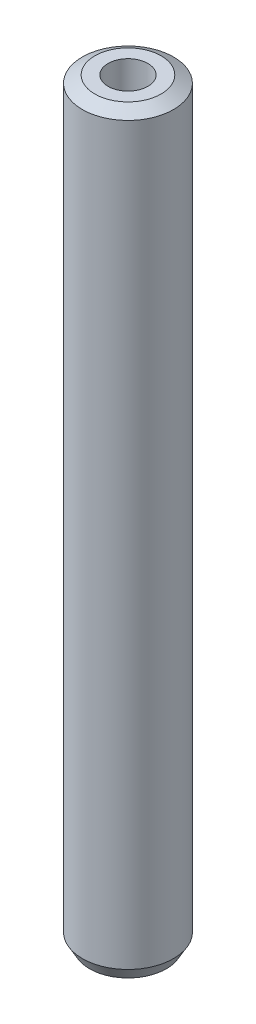
ISO-10303-21;
HEADER;
FILE_DESCRIPTION(('STEP AP214'),'2;1');
FILE_NAME('part.step','',(''),(''),'','','');
FILE_SCHEMA(('AUTOMOTIVE_DESIGN { 1 0 10303 214 1 1 1 1 }'));
ENDSEC;
DATA;
#1=APPLICATION_CONTEXT('core data for automotive mechanical design processes');
#2=APPLICATION_PROTOCOL_DEFINITION('international standard','automotive_design',2000,#1);
#3=PRODUCT_CONTEXT('',#1,'mechanical');
#4=PRODUCT('Part','Part','',(#3));
#5=PRODUCT_RELATED_PRODUCT_CATEGORY('part','',(#4));
#6=PRODUCT_DEFINITION_FORMATION('','',#4);
#7=PRODUCT_DEFINITION_CONTEXT('part definition',#1,'design');
#8=PRODUCT_DEFINITION('design','',#6,#7);
#9=PRODUCT_DEFINITION_SHAPE('','',#8);
#10=(LENGTH_UNIT() NAMED_UNIT(*) SI_UNIT(.MILLI.,.METRE.));
#11=(NAMED_UNIT(*) PLANE_ANGLE_UNIT() SI_UNIT($,.RADIAN.));
#12=(NAMED_UNIT(*) SI_UNIT($,.STERADIAN.) SOLID_ANGLE_UNIT());
#13=UNCERTAINTY_MEASURE_WITH_UNIT(LENGTH_MEASURE(1.E-05),#10,'distance_accuracy_value','');
#14=(GEOMETRIC_REPRESENTATION_CONTEXT(3) GLOBAL_UNCERTAINTY_ASSIGNED_CONTEXT((#13)) GLOBAL_UNIT_ASSIGNED_CONTEXT((#10,
#11,#12)) REPRESENTATION_CONTEXT('',''));
#15=CARTESIAN_POINT('',(0.,0.,0.));
#16=DIRECTION('',(0.,0.,1.));
#17=DIRECTION('',(1.,0.,0.));
#18=AXIS2_PLACEMENT_3D('',#15,#16,#17);
#19=CARTESIAN_POINT('',(0.,455.307275642714,0.));
#20=DIRECTION('',(0.,-1.,0.));
#21=DIRECTION('',(0.,0.,-1.));
#22=AXIS2_PLACEMENT_3D('',#19,#20,#21);
#23=CYLINDRICAL_SURFACE('',#22,27.5);
#24=CARTESIAN_POINT('',(0.,450.961119727141,0.));
#25=DIRECTION('',(0.,1.,0.));
#26=DIRECTION('',(0.,0.,1.));
#27=AXIS2_PLACEMENT_3D('',#24,#25,#26);
#28=CIRCLE('',#27,27.5);
#29=CARTESIAN_POINT('',(0.,450.961119727141,27.5));
#30=VERTEX_POINT('',#29);
#31=EDGE_CURVE('E50',#30,#30,#28,.F.);
#32=ORIENTED_EDGE('',*,*,#31,.T.);
#33=EDGE_LOOP('',(#32));
#34=FACE_BOUND('',#33,.T.);
#35=CARTESIAN_POINT('',(0.,7.52776286338952,0.));
#36=DIRECTION('',(0.,1.,0.));
#37=DIRECTION('',(0.,0.,1.));
#38=AXIS2_PLACEMENT_3D('',#35,#36,#37);
#39=CIRCLE('',#38,27.5);
#40=CARTESIAN_POINT('',(0.,7.52776286338952,27.5));
#41=VERTEX_POINT('',#40);
#42=EDGE_CURVE('E51',#41,#41,#39,.T.);
#43=ORIENTED_EDGE('',*,*,#42,.T.);
#44=EDGE_LOOP('',(#43));
#45=FACE_BOUND('',#44,.T.);
#46=ADVANCED_FACE('F39',(#34,#45),#23,.T.);
#47=CARTESIAN_POINT('',(0.,455.307275642714,0.));
#48=DIRECTION('',(0.,1.,0.));
#49=DIRECTION('',(0.,0.,1.));
#50=AXIS2_PLACEMENT_3D('',#47,#48,#49);
#51=PLANE('',#50);
#52=CARTESIAN_POINT('',(0.,455.307275642714,0.));
#53=DIRECTION('',(0.,1.,0.));
#54=DIRECTION('',(0.,0.,1.));
#55=AXIS2_PLACEMENT_3D('',#52,#53,#54);
#56=CIRCLE('',#55,19.9722371366106);
#57=CARTESIAN_POINT('',(0.,455.307275642714,19.9722371366106));
#58=VERTEX_POINT('',#57);
#59=EDGE_CURVE('E54',#58,#58,#56,.T.);
#60=ORIENTED_EDGE('',*,*,#59,.T.);
#61=EDGE_LOOP('',(#60));
#62=FACE_BOUND('',#61,.T.);
#63=CARTESIAN_POINT('',(0.,455.307275642714,0.));
#64=DIRECTION('',(0.,1.,0.));
#65=DIRECTION('',(0.,0.,1.));
#66=AXIS2_PLACEMENT_3D('',#63,#64,#65);
#67=CIRCLE('',#66,12.0033930726641);
#68=CARTESIAN_POINT('',(0.,455.307275642714,12.0033930726641));
#69=VERTEX_POINT('',#68);
#70=EDGE_CURVE('E58',#69,#69,#67,.T.);
#71=ORIENTED_EDGE('',*,*,#70,.F.);
#72=EDGE_LOOP('',(#71));
#73=FACE_BOUND('',#72,.T.);
#74=ADVANCED_FACE('F69',(#62,#73),#51,.T.);
#75=CARTESIAN_POINT('',(0.,0.,0.));
#76=DIRECTION('',(0.,1.,0.));
#77=DIRECTION('',(0.,0.,1.));
#78=AXIS2_PLACEMENT_3D('',#75,#76,#77);
#79=PLANE('',#78);
#80=CARTESIAN_POINT('',(0.,0.,0.));
#81=DIRECTION('',(0.,1.,0.));
#82=DIRECTION('',(0.,0.,1.));
#83=AXIS2_PLACEMENT_3D('',#80,#81,#82);
#84=CIRCLE('',#83,23.1538440844264);
#85=CARTESIAN_POINT('',(0.,0.,23.1538440844264));
#86=VERTEX_POINT('',#85);
#87=EDGE_CURVE('E10',#86,#86,#84,.F.);
#88=ORIENTED_EDGE('',*,*,#87,.T.);
#89=EDGE_LOOP('',(#88));
#90=FACE_BOUND('',#89,.T.);
#91=CARTESIAN_POINT('',(0.,0.,0.));
#92=DIRECTION('',(0.,1.,0.));
#93=DIRECTION('',(0.,0.,1.));
#94=AXIS2_PLACEMENT_3D('',#91,#92,#93);
#95=CIRCLE('',#94,12.0033930726641);
#96=CARTESIAN_POINT('',(0.,0.,12.0033930726641));
#97=VERTEX_POINT('',#96);
#98=EDGE_CURVE('E63',#97,#97,#95,.T.);
#99=ORIENTED_EDGE('',*,*,#98,.T.);
#100=EDGE_LOOP('',(#99));
#101=FACE_BOUND('',#100,.T.);
#102=ADVANCED_FACE('F75',(#90,#101),#79,.F.);
#103=CARTESIAN_POINT('',(0.,455.307275642714,0.));
#104=DIRECTION('',(0.,-1.,0.));
#105=DIRECTION('',(0.,0.,-1.));
#106=AXIS2_PLACEMENT_3D('',#103,#104,#105);
#107=CYLINDRICAL_SURFACE('',#106,12.0033930726641);
#108=ORIENTED_EDGE('',*,*,#70,.T.);
#109=EDGE_LOOP('',(#108));
#110=FACE_BOUND('',#109,.T.);
#111=ORIENTED_EDGE('',*,*,#98,.F.);
#112=EDGE_LOOP('',(#111));
#113=FACE_BOUND('',#112,.T.);
#114=ADVANCED_FACE('F70',(#110,#113),#107,.F.);
#115=CARTESIAN_POINT('',(0.,455.307275642714,0.));
#116=DIRECTION('',(0.,-1.,0.));
#117=DIRECTION('',(0.,0.,-1.));
#118=AXIS2_PLACEMENT_3D('',#115,#116,#117);
#119=CONICAL_SURFACE('',#118,19.9722371366106,1.0471975511966);
#120=ORIENTED_EDGE('',*,*,#31,.F.);
#121=EDGE_LOOP('',(#120));
#122=FACE_BOUND('',#121,.T.);
#123=ORIENTED_EDGE('',*,*,#59,.F.);
#124=EDGE_LOOP('',(#123));
#125=FACE_BOUND('',#124,.T.);
#126=ADVANCED_FACE('F81',(#122,#125),#119,.T.);
#127=CARTESIAN_POINT('',(0.,7.52776286338952,0.));
#128=DIRECTION('',(0.,1.,0.));
#129=DIRECTION('',(0.,0.,1.));
#130=AXIS2_PLACEMENT_3D('',#127,#128,#129);
#131=CONICAL_SURFACE('',#130,27.5,0.523598775598302);
#132=ORIENTED_EDGE('',*,*,#87,.F.);
#133=EDGE_LOOP('',(#132));
#134=FACE_BOUND('',#133,.T.);
#135=ORIENTED_EDGE('',*,*,#42,.F.);
#136=EDGE_LOOP('',(#135));
#137=FACE_BOUND('',#136,.T.);
#138=ADVANCED_FACE('F45',(#134,#137),#131,.T.);
#139=CLOSED_SHELL('',(#46,#74,#102,#114,#126,#138));
#140=MANIFOLD_SOLID_BREP('B2',#139);
#141=ADVANCED_BREP_SHAPE_REPRESENTATION('',(#18,#140),#14);
#142=SHAPE_DEFINITION_REPRESENTATION(#9,#141);
ENDSEC;
END-ISO-10303-21;
